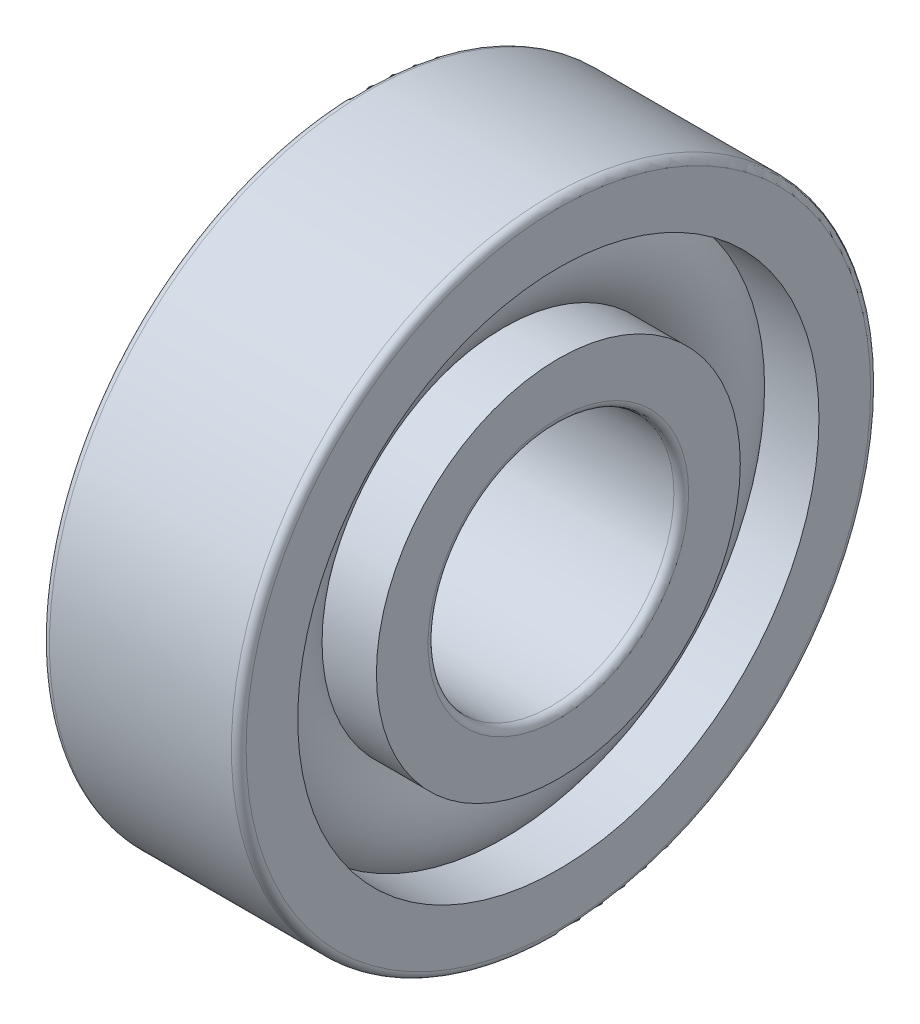
ISO-10303-21;
HEADER;
FILE_DESCRIPTION(('STEP AP214'),'2;1');
FILE_NAME('part.step','',(''),(''),'','','');
FILE_SCHEMA(('AUTOMOTIVE_DESIGN { 1 0 10303 214 1 1 1 1 }'));
ENDSEC;
DATA;
#1=APPLICATION_CONTEXT('core data for automotive mechanical design processes');
#2=APPLICATION_PROTOCOL_DEFINITION('international standard','automotive_design',2000,#1);
#3=PRODUCT_CONTEXT('',#1,'mechanical');
#4=PRODUCT('Part','Part','',(#3));
#5=PRODUCT_RELATED_PRODUCT_CATEGORY('part','',(#4));
#6=PRODUCT_DEFINITION_FORMATION('','',#4);
#7=PRODUCT_DEFINITION_CONTEXT('part definition',#1,'design');
#8=PRODUCT_DEFINITION('design','',#6,#7);
#9=PRODUCT_DEFINITION_SHAPE('','',#8);
#10=(LENGTH_UNIT() NAMED_UNIT(*) SI_UNIT(.MILLI.,.METRE.));
#11=(NAMED_UNIT(*) PLANE_ANGLE_UNIT() SI_UNIT($,.RADIAN.));
#12=(NAMED_UNIT(*) SI_UNIT($,.STERADIAN.) SOLID_ANGLE_UNIT());
#13=UNCERTAINTY_MEASURE_WITH_UNIT(LENGTH_MEASURE(1.E-05),#10,'distance_accuracy_value','');
#14=(GEOMETRIC_REPRESENTATION_CONTEXT(3) GLOBAL_UNCERTAINTY_ASSIGNED_CONTEXT((#13)) GLOBAL_UNIT_ASSIGNED_CONTEXT((#10,
#11,#12)) REPRESENTATION_CONTEXT('',''));
#15=CARTESIAN_POINT('',(0.,0.,0.));
#16=DIRECTION('',(0.,0.,1.));
#17=DIRECTION('',(1.,0.,0.));
#18=AXIS2_PLACEMENT_3D('',#15,#16,#17);
#19=CARTESIAN_POINT('',(0.,0.,0.));
#20=DIRECTION('',(-1.,0.,0.));
#21=DIRECTION('',(0.,0.,1.));
#22=AXIS2_PLACEMENT_3D('',#19,#20,#21);
#23=TOROIDAL_SURFACE('',#22,9.,2.4);
#24=CARTESIAN_POINT('',(1.78885438199983,0.,0.));
#25=DIRECTION('',(-1.,0.,0.));
#26=DIRECTION('',(0.,0.,1.));
#27=AXIS2_PLACEMENT_3D('',#24,#25,#26);
#28=CIRCLE('',#27,10.6);
#29=CARTESIAN_POINT('',(1.78885438199983,0.,10.6));
#30=VERTEX_POINT('',#29);
#31=EDGE_CURVE('E35',#30,#30,#28,.F.);
#32=ORIENTED_EDGE('',*,*,#31,.T.);
#33=EDGE_LOOP('',(#32));
#34=FACE_BOUND('',#33,.T.);
#35=CARTESIAN_POINT('',(1.78885438199983,0.,0.));
#36=DIRECTION('',(-1.,0.,0.));
#37=DIRECTION('',(0.,0.,1.));
#38=AXIS2_PLACEMENT_3D('',#35,#36,#37);
#39=CIRCLE('',#38,7.4);
#40=CARTESIAN_POINT('',(1.78885438199983,0.,7.4));
#41=VERTEX_POINT('',#40);
#42=EDGE_CURVE('E10',#41,#41,#39,.T.);
#43=ORIENTED_EDGE('',*,*,#42,.T.);
#44=EDGE_LOOP('',(#43));
#45=FACE_BOUND('',#44,.T.);
#46=ADVANCED_FACE('F31',(#34,#45),#23,.T.);
#47=CARTESIAN_POINT('',(-20.6375,0.,0.));
#48=DIRECTION('',(1.,0.,0.));
#49=DIRECTION('',(0.,0.,-1.));
#50=AXIS2_PLACEMENT_3D('',#47,#48,#49);
#51=CYLINDRICAL_SURFACE('',#50,7.4);
#52=CARTESIAN_POINT('',(4.,0.,0.));
#53=DIRECTION('',(1.,0.,0.));
#54=DIRECTION('',(0.,0.,-1.));
#55=AXIS2_PLACEMENT_3D('',#52,#53,#54);
#56=CIRCLE('',#55,7.4);
#57=CARTESIAN_POINT('',(4.,0.,-7.4));
#58=VERTEX_POINT('',#57);
#59=EDGE_CURVE('E44',#58,#58,#56,.T.);
#60=ORIENTED_EDGE('',*,*,#59,.F.);
#61=EDGE_LOOP('',(#60));
#62=FACE_BOUND('',#61,.T.);
#63=ORIENTED_EDGE('',*,*,#42,.F.);
#64=EDGE_LOOP('',(#63));
#65=FACE_BOUND('',#64,.T.);
#66=ADVANCED_FACE('F83',(#62,#65),#51,.T.);
#67=CARTESIAN_POINT('',(-20.6375,0.,0.));
#68=DIRECTION('',(1.,0.,0.));
#69=DIRECTION('',(0.,0.,-1.));
#70=AXIS2_PLACEMENT_3D('',#67,#68,#69);
#71=CYLINDRICAL_SURFACE('',#70,7.4);
#72=CARTESIAN_POINT('',(-4.,0.,0.));
#73=DIRECTION('',(1.,0.,0.));
#74=DIRECTION('',(0.,0.,-1.));
#75=AXIS2_PLACEMENT_3D('',#72,#73,#74);
#76=CIRCLE('',#75,7.4);
#77=CARTESIAN_POINT('',(-4.,0.,-7.4));
#78=VERTEX_POINT('',#77);
#79=EDGE_CURVE('E53',#78,#78,#76,.T.);
#80=ORIENTED_EDGE('',*,*,#79,.T.);
#81=EDGE_LOOP('',(#80));
#82=FACE_BOUND('',#81,.T.);
#83=CARTESIAN_POINT('',(-1.78885438199983,0.,0.));
#84=DIRECTION('',(1.,0.,0.));
#85=DIRECTION('',(0.,0.,-1.));
#86=AXIS2_PLACEMENT_3D('',#83,#84,#85);
#87=CIRCLE('',#86,7.4);
#88=CARTESIAN_POINT('',(-1.78885438199983,0.,-7.4));
#89=VERTEX_POINT('',#88);
#90=EDGE_CURVE('E39',#89,#89,#87,.T.);
#91=ORIENTED_EDGE('',*,*,#90,.F.);
#92=EDGE_LOOP('',(#91));
#93=FACE_BOUND('',#92,.T.);
#94=ADVANCED_FACE('F86',(#82,#93),#71,.T.);
#95=CARTESIAN_POINT('',(4.,5.3,0.));
#96=DIRECTION('',(1.,0.,0.));
#97=DIRECTION('',(0.,0.,-1.));
#98=AXIS2_PLACEMENT_3D('',#95,#96,#97);
#99=PLANE('',#98);
#100=ORIENTED_EDGE('',*,*,#59,.T.);
#101=EDGE_LOOP('',(#100));
#102=FACE_BOUND('',#101,.T.);
#103=CARTESIAN_POINT('',(4.,0.,0.));
#104=DIRECTION('',(1.,0.,0.));
#105=DIRECTION('',(0.,0.,-1.));
#106=AXIS2_PLACEMENT_3D('',#103,#104,#105);
#107=CIRCLE('',#106,5.3);
#108=CARTESIAN_POINT('',(4.,0.,-5.3));
#109=VERTEX_POINT('',#108);
#110=EDGE_CURVE('E75',#109,#109,#107,.T.);
#111=ORIENTED_EDGE('',*,*,#110,.F.);
#112=EDGE_LOOP('',(#111));
#113=FACE_BOUND('',#112,.T.);
#114=ADVANCED_FACE('F80',(#102,#113),#99,.T.);
#115=CARTESIAN_POINT('',(3.7,0.,0.));
#116=DIRECTION('',(1.,0.,0.));
#117=DIRECTION('',(0.,0.,-1.));
#118=AXIS2_PLACEMENT_3D('',#115,#116,#117);
#119=TOROIDAL_SURFACE('',#118,5.3,0.3);
#120=ORIENTED_EDGE('',*,*,#110,.T.);
#121=EDGE_LOOP('',(#120));
#122=FACE_BOUND('',#121,.T.);
#123=CARTESIAN_POINT('',(3.7,0.,0.));
#124=DIRECTION('',(1.,0.,0.));
#125=DIRECTION('',(0.,0.,-1.));
#126=AXIS2_PLACEMENT_3D('',#123,#124,#125);
#127=CIRCLE('',#126,5.);
#128=CARTESIAN_POINT('',(3.7,0.,-5.));
#129=VERTEX_POINT('',#128);
#130=EDGE_CURVE('E72',#129,#129,#127,.T.);
#131=ORIENTED_EDGE('',*,*,#130,.F.);
#132=EDGE_LOOP('',(#131));
#133=FACE_BOUND('',#132,.T.);
#134=ADVANCED_FACE('F97',(#122,#133),#119,.T.);
#135=CARTESIAN_POINT('',(-20.6375,0.,0.));
#136=DIRECTION('',(1.,0.,0.));
#137=DIRECTION('',(0.,0.,-1.));
#138=AXIS2_PLACEMENT_3D('',#135,#136,#137);
#139=CYLINDRICAL_SURFACE('',#138,5.);
#140=ORIENTED_EDGE('',*,*,#130,.T.);
#141=EDGE_LOOP('',(#140));
#142=FACE_BOUND('',#141,.T.);
#143=CARTESIAN_POINT('',(-3.7,0.,0.));
#144=DIRECTION('',(1.,0.,0.));
#145=DIRECTION('',(0.,0.,-1.));
#146=AXIS2_PLACEMENT_3D('',#143,#144,#145);
#147=CIRCLE('',#146,5.);
#148=CARTESIAN_POINT('',(-3.7,0.,-5.));
#149=VERTEX_POINT('',#148);
#150=EDGE_CURVE('E69',#149,#149,#147,.T.);
#151=ORIENTED_EDGE('',*,*,#150,.F.);
#152=EDGE_LOOP('',(#151));
#153=FACE_BOUND('',#152,.T.);
#154=ADVANCED_FACE('F100',(#142,#153),#139,.F.);
#155=CARTESIAN_POINT('',(-3.7,0.,0.));
#156=DIRECTION('',(1.,0.,0.));
#157=DIRECTION('',(0.,0.,-1.));
#158=AXIS2_PLACEMENT_3D('',#155,#156,#157);
#159=TOROIDAL_SURFACE('',#158,5.3,0.3);
#160=ORIENTED_EDGE('',*,*,#150,.T.);
#161=EDGE_LOOP('',(#160));
#162=FACE_BOUND('',#161,.T.);
#163=CARTESIAN_POINT('',(-4.,0.,0.));
#164=DIRECTION('',(1.,0.,0.));
#165=DIRECTION('',(0.,0.,-1.));
#166=AXIS2_PLACEMENT_3D('',#163,#164,#165);
#167=CIRCLE('',#166,5.3);
#168=CARTESIAN_POINT('',(-4.,0.,-5.3));
#169=VERTEX_POINT('',#168);
#170=EDGE_CURVE('E66',#169,#169,#167,.T.);
#171=ORIENTED_EDGE('',*,*,#170,.F.);
#172=EDGE_LOOP('',(#171));
#173=FACE_BOUND('',#172,.T.);
#174=ADVANCED_FACE('F104',(#162,#173),#159,.T.);
#175=CARTESIAN_POINT('',(-4.,7.4,0.));
#176=DIRECTION('',(-1.,0.,0.));
#177=DIRECTION('',(0.,0.,1.));
#178=AXIS2_PLACEMENT_3D('',#175,#176,#177);
#179=PLANE('',#178);
#180=ORIENTED_EDGE('',*,*,#170,.T.);
#181=EDGE_LOOP('',(#180));
#182=FACE_BOUND('',#181,.T.);
#183=ORIENTED_EDGE('',*,*,#79,.F.);
#184=EDGE_LOOP('',(#183));
#185=FACE_BOUND('',#184,.T.);
#186=ADVANCED_FACE('F108',(#182,#185),#179,.T.);
#187=CARTESIAN_POINT('',(-1.78885438199983,0.,0.));
#188=DIRECTION('',(1.,0.,0.));
#189=DIRECTION('',(0.,0.,-1.));
#190=AXIS2_PLACEMENT_3D('',#187,#188,#189);
#191=CIRCLE('',#190,10.6);
#192=CARTESIAN_POINT('',(-1.78885438199983,0.,-10.6));
#193=VERTEX_POINT('',#192);
#194=EDGE_CURVE('E47',#193,#193,#191,.F.);
#195=ORIENTED_EDGE('',*,*,#194,.T.);
#196=EDGE_LOOP('',(#195));
#197=FACE_BOUND('',#196,.T.);
#198=ORIENTED_EDGE('',*,*,#90,.T.);
#199=EDGE_LOOP('',(#198));
#200=FACE_BOUND('',#199,.T.);
#201=ADVANCED_FACE('F33',(#197,#200),#23,.T.);
#202=CARTESIAN_POINT('',(-20.6375,0.,0.));
#203=DIRECTION('',(1.,0.,0.));
#204=DIRECTION('',(0.,0.,-1.));
#205=AXIS2_PLACEMENT_3D('',#202,#203,#204);
#206=CYLINDRICAL_SURFACE('',#205,10.6);
#207=CARTESIAN_POINT('',(4.,0.,0.));
#208=DIRECTION('',(1.,0.,0.));
#209=DIRECTION('',(0.,0.,-1.));
#210=AXIS2_PLACEMENT_3D('',#207,#208,#209);
#211=CIRCLE('',#210,10.6);
#212=CARTESIAN_POINT('',(4.,0.,-10.6));
#213=VERTEX_POINT('',#212);
#214=EDGE_CURVE('E49',#213,#213,#211,.T.);
#215=ORIENTED_EDGE('',*,*,#214,.T.);
#216=EDGE_LOOP('',(#215));
#217=FACE_BOUND('',#216,.T.);
#218=ORIENTED_EDGE('',*,*,#31,.F.);
#219=EDGE_LOOP('',(#218));
#220=FACE_BOUND('',#219,.T.);
#221=ADVANCED_FACE('F113',(#217,#220),#206,.F.);
#222=CARTESIAN_POINT('',(-20.6375,0.,0.));
#223=DIRECTION('',(1.,0.,0.));
#224=DIRECTION('',(0.,0.,-1.));
#225=AXIS2_PLACEMENT_3D('',#222,#223,#224);
#226=CYLINDRICAL_SURFACE('',#225,10.6);
#227=CARTESIAN_POINT('',(-4.,0.,0.));
#228=DIRECTION('',(1.,0.,0.));
#229=DIRECTION('',(0.,0.,-1.));
#230=AXIS2_PLACEMENT_3D('',#227,#228,#229);
#231=CIRCLE('',#230,10.6);
#232=CARTESIAN_POINT('',(-4.,0.,-10.6));
#233=VERTEX_POINT('',#232);
#234=EDGE_CURVE('E144',#233,#233,#231,.T.);
#235=ORIENTED_EDGE('',*,*,#234,.F.);
#236=EDGE_LOOP('',(#235));
#237=FACE_BOUND('',#236,.T.);
#238=ORIENTED_EDGE('',*,*,#194,.F.);
#239=EDGE_LOOP('',(#238));
#240=FACE_BOUND('',#239,.T.);
#241=ADVANCED_FACE('F116',(#237,#240),#226,.F.);
#242=CARTESIAN_POINT('',(4.,12.7,0.));
#243=DIRECTION('',(1.,0.,0.));
#244=DIRECTION('',(0.,0.,-1.));
#245=AXIS2_PLACEMENT_3D('',#242,#243,#244);
#246=PLANE('',#245);
#247=CARTESIAN_POINT('',(4.,0.,0.));
#248=DIRECTION('',(1.,0.,0.));
#249=DIRECTION('',(0.,0.,-1.));
#250=AXIS2_PLACEMENT_3D('',#247,#248,#249);
#251=CIRCLE('',#250,12.7);
#252=CARTESIAN_POINT('',(4.,0.,-12.7));
#253=VERTEX_POINT('',#252);
#254=EDGE_CURVE('E55',#253,#253,#251,.T.);
#255=ORIENTED_EDGE('',*,*,#254,.T.);
#256=EDGE_LOOP('',(#255));
#257=FACE_BOUND('',#256,.T.);
#258=ORIENTED_EDGE('',*,*,#214,.F.);
#259=EDGE_LOOP('',(#258));
#260=FACE_BOUND('',#259,.T.);
#261=ADVANCED_FACE('F117',(#257,#260),#246,.T.);
#262=CARTESIAN_POINT('',(3.7,0.,0.));
#263=DIRECTION('',(1.,0.,0.));
#264=DIRECTION('',(0.,0.,-1.));
#265=AXIS2_PLACEMENT_3D('',#262,#263,#264);
#266=TOROIDAL_SURFACE('',#265,12.7,0.300000000000001);
#267=CARTESIAN_POINT('',(3.7,0.,0.));
#268=DIRECTION('',(1.,0.,0.));
#269=DIRECTION('',(0.,0.,-1.));
#270=AXIS2_PLACEMENT_3D('',#267,#268,#269);
#271=CIRCLE('',#270,13.);
#272=CARTESIAN_POINT('',(3.7,0.,-13.));
#273=VERTEX_POINT('',#272);
#274=EDGE_CURVE('E60',#273,#273,#271,.T.);
#275=ORIENTED_EDGE('',*,*,#274,.T.);
#276=EDGE_LOOP('',(#275));
#277=FACE_BOUND('',#276,.T.);
#278=ORIENTED_EDGE('',*,*,#254,.F.);
#279=EDGE_LOOP('',(#278));
#280=FACE_BOUND('',#279,.T.);
#281=ADVANCED_FACE('F120',(#277,#280),#266,.T.);
#282=CARTESIAN_POINT('',(-20.6375,0.,0.));
#283=DIRECTION('',(1.,0.,0.));
#284=DIRECTION('',(0.,0.,-1.));
#285=AXIS2_PLACEMENT_3D('',#282,#283,#284);
#286=CYLINDRICAL_SURFACE('',#285,13.);
#287=CARTESIAN_POINT('',(-3.7,0.,0.));
#288=DIRECTION('',(1.,0.,0.));
#289=DIRECTION('',(0.,0.,-1.));
#290=AXIS2_PLACEMENT_3D('',#287,#288,#289);
#291=CIRCLE('',#290,13.);
#292=CARTESIAN_POINT('',(-3.7,0.,-13.));
#293=VERTEX_POINT('',#292);
#294=EDGE_CURVE('E148',#293,#293,#291,.T.);
#295=ORIENTED_EDGE('',*,*,#294,.T.);
#296=EDGE_LOOP('',(#295));
#297=FACE_BOUND('',#296,.T.);
#298=ORIENTED_EDGE('',*,*,#274,.F.);
#299=EDGE_LOOP('',(#298));
#300=FACE_BOUND('',#299,.T.);
#301=ADVANCED_FACE('F124',(#297,#300),#286,.T.);
#302=CARTESIAN_POINT('',(-3.7,0.,0.));
#303=DIRECTION('',(1.,0.,0.));
#304=DIRECTION('',(0.,0.,-1.));
#305=AXIS2_PLACEMENT_3D('',#302,#303,#304);
#306=TOROIDAL_SURFACE('',#305,12.7,0.300000000000001);
#307=CARTESIAN_POINT('',(-4.,0.,0.));
#308=DIRECTION('',(1.,0.,0.));
#309=DIRECTION('',(0.,0.,-1.));
#310=AXIS2_PLACEMENT_3D('',#307,#308,#309);
#311=CIRCLE('',#310,12.7);
#312=CARTESIAN_POINT('',(-4.,0.,-12.7));
#313=VERTEX_POINT('',#312);
#314=EDGE_CURVE('E145',#313,#313,#311,.T.);
#315=ORIENTED_EDGE('',*,*,#314,.T.);
#316=EDGE_LOOP('',(#315));
#317=FACE_BOUND('',#316,.T.);
#318=ORIENTED_EDGE('',*,*,#294,.F.);
#319=EDGE_LOOP('',(#318));
#320=FACE_BOUND('',#319,.T.);
#321=ADVANCED_FACE('F128',(#317,#320),#306,.T.);
#322=CARTESIAN_POINT('',(-4.,10.6,0.));
#323=DIRECTION('',(-1.,0.,0.));
#324=DIRECTION('',(0.,0.,1.));
#325=AXIS2_PLACEMENT_3D('',#322,#323,#324);
#326=PLANE('',#325);
#327=ORIENTED_EDGE('',*,*,#234,.T.);
#328=EDGE_LOOP('',(#327));
#329=FACE_BOUND('',#328,.T.);
#330=ORIENTED_EDGE('',*,*,#314,.F.);
#331=EDGE_LOOP('',(#330));
#332=FACE_BOUND('',#331,.T.);
#333=ADVANCED_FACE('F132',(#329,#332),#326,.T.);
#334=CLOSED_SHELL('',(#46,#66,#94,#114,#134,#154,#174,#186,#201,#221,#241,#261,#281,#301,#321,#333));
#335=MANIFOLD_SOLID_BREP('B2',#334);
#336=ADVANCED_BREP_SHAPE_REPRESENTATION('',(#18,#335),#14);
#337=SHAPE_DEFINITION_REPRESENTATION(#9,#336);
ENDSEC;
END-ISO-10303-21;
